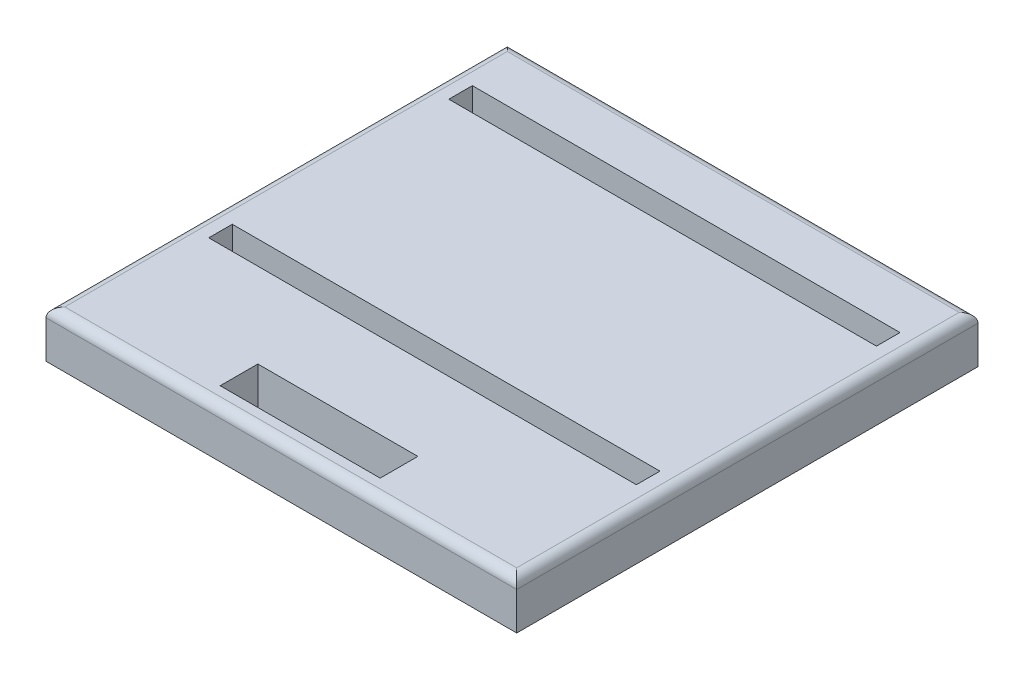
ISO-10303-21;
HEADER;
FILE_DESCRIPTION(('STEP AP214'),'2;1');
FILE_NAME('part.step','',(''),(''),'','','');
FILE_SCHEMA(('AUTOMOTIVE_DESIGN { 1 0 10303 214 1 1 1 1 }'));
ENDSEC;
DATA;
#1=APPLICATION_CONTEXT('core data for automotive mechanical design processes');
#2=APPLICATION_PROTOCOL_DEFINITION('international standard','automotive_design',2000,#1);
#3=PRODUCT_CONTEXT('',#1,'mechanical');
#4=PRODUCT('Part','Part','',(#3));
#5=PRODUCT_RELATED_PRODUCT_CATEGORY('part','',(#4));
#6=PRODUCT_DEFINITION_FORMATION('','',#4);
#7=PRODUCT_DEFINITION_CONTEXT('part definition',#1,'design');
#8=PRODUCT_DEFINITION('design','',#6,#7);
#9=PRODUCT_DEFINITION_SHAPE('','',#8);
#10=(LENGTH_UNIT() NAMED_UNIT(*) SI_UNIT(.MILLI.,.METRE.));
#11=(NAMED_UNIT(*) PLANE_ANGLE_UNIT() SI_UNIT($,.RADIAN.));
#12=(NAMED_UNIT(*) SI_UNIT($,.STERADIAN.) SOLID_ANGLE_UNIT());
#13=UNCERTAINTY_MEASURE_WITH_UNIT(LENGTH_MEASURE(1.E-05),#10,'distance_accuracy_value','');
#14=(GEOMETRIC_REPRESENTATION_CONTEXT(3) GLOBAL_UNCERTAINTY_ASSIGNED_CONTEXT((#13)) GLOBAL_UNIT_ASSIGNED_CONTEXT((#10,
#11,#12)) REPRESENTATION_CONTEXT('',''));
#15=CARTESIAN_POINT('',(0.,0.,0.));
#16=DIRECTION('',(0.,0.,1.));
#17=DIRECTION('',(1.,0.,0.));
#18=AXIS2_PLACEMENT_3D('',#15,#16,#17);
#19=CARTESIAN_POINT('',(-63.5,12.7,-81.28));
#20=DIRECTION('',(0.,0.,1.));
#21=DIRECTION('',(1.,0.,0.));
#22=AXIS2_PLACEMENT_3D('',#19,#20,#21);
#23=PLANE('',#22);
#24=DIRECTION('',(0.,-1.,0.));
#25=VECTOR('',#24,1.);
#26=CARTESIAN_POINT('',(-63.5,12.7,-81.28));
#27=LINE('',#26,#25);
#28=CARTESIAN_POINT('',(-63.5,10.16,-81.28));
#29=VERTEX_POINT('',#28);
#30=CARTESIAN_POINT('',(-63.5,0.,-81.28));
#31=VERTEX_POINT('',#30);
#32=EDGE_CURVE('E329',#29,#31,#27,.T.);
#33=ORIENTED_EDGE('',*,*,#32,.F.);
#34=DIRECTION('',(-1.,0.,0.));
#35=VECTOR('',#34,1.);
#36=CARTESIAN_POINT('',(-63.5,10.16,-81.28));
#37=LINE('',#36,#35);
#38=CARTESIAN_POINT('',(63.5,10.16,-81.28));
#39=VERTEX_POINT('',#38);
#40=EDGE_CURVE('E11',#29,#39,#37,.F.);
#41=ORIENTED_EDGE('',*,*,#40,.T.);
#42=DIRECTION('',(0.,-1.,0.));
#43=VECTOR('',#42,1.);
#44=CARTESIAN_POINT('',(63.5,12.7,-81.28));
#45=LINE('',#44,#43);
#46=CARTESIAN_POINT('',(63.5,0.,-81.28));
#47=VERTEX_POINT('',#46);
#48=EDGE_CURVE('E320',#39,#47,#45,.T.);
#49=ORIENTED_EDGE('',*,*,#48,.T.);
#50=DIRECTION('',(-1.,0.,0.));
#51=VECTOR('',#50,1.);
#52=CARTESIAN_POINT('',(-63.5,0.,-81.28));
#53=LINE('',#52,#51);
#54=EDGE_CURVE('E304',#47,#31,#53,.T.);
#55=ORIENTED_EDGE('',*,*,#54,.T.);
#56=EDGE_LOOP('',(#33,#41,#49,#55));
#57=FACE_BOUND('',#56,.T.);
#58=ADVANCED_FACE('F39',(#57),#23,.F.);
#59=CARTESIAN_POINT('',(-63.5,12.7,-81.28));
#60=DIRECTION('',(1.,0.,0.));
#61=DIRECTION('',(0.,0.,-1.));
#62=AXIS2_PLACEMENT_3D('',#59,#60,#61);
#63=PLANE('',#62);
#64=DIRECTION('',(0.,-1.,0.));
#65=VECTOR('',#64,1.);
#66=CARTESIAN_POINT('',(-63.5,12.7,43.18));
#67=LINE('',#66,#65);
#68=CARTESIAN_POINT('',(-63.5,10.16,43.18));
#69=VERTEX_POINT('',#68);
#70=CARTESIAN_POINT('',(-63.5,0.,43.18));
#71=VERTEX_POINT('',#70);
#72=EDGE_CURVE('E326',#69,#71,#67,.T.);
#73=ORIENTED_EDGE('',*,*,#72,.F.);
#74=DIRECTION('',(0.,0.,1.));
#75=VECTOR('',#74,1.);
#76=CARTESIAN_POINT('',(-63.5,10.16,-81.28));
#77=LINE('',#76,#75);
#78=EDGE_CURVE('E349',#69,#29,#77,.F.);
#79=ORIENTED_EDGE('',*,*,#78,.T.);
#80=ORIENTED_EDGE('',*,*,#32,.T.);
#81=DIRECTION('',(0.,0.,1.));
#82=VECTOR('',#81,1.);
#83=CARTESIAN_POINT('',(-63.5,0.,-81.28));
#84=LINE('',#83,#82);
#85=EDGE_CURVE('E308',#31,#71,#84,.T.);
#86=ORIENTED_EDGE('',*,*,#85,.T.);
#87=EDGE_LOOP('',(#73,#79,#80,#86));
#88=FACE_BOUND('',#87,.T.);
#89=ADVANCED_FACE('F379',(#88),#63,.F.);
#90=CARTESIAN_POINT('',(-63.5,12.7,43.18));
#91=DIRECTION('',(0.,0.,-1.));
#92=DIRECTION('',(-1.,0.,0.));
#93=AXIS2_PLACEMENT_3D('',#90,#91,#92);
#94=PLANE('',#93);
#95=DIRECTION('',(0.,-1.,0.));
#96=VECTOR('',#95,1.);
#97=CARTESIAN_POINT('',(63.5,12.7,43.18));
#98=LINE('',#97,#96);
#99=CARTESIAN_POINT('',(63.5,10.16,43.18));
#100=VERTEX_POINT('',#99);
#101=CARTESIAN_POINT('',(63.5,0.,43.18));
#102=VERTEX_POINT('',#101);
#103=EDGE_CURVE('E323',#100,#102,#98,.T.);
#104=ORIENTED_EDGE('',*,*,#103,.F.);
#105=DIRECTION('',(1.,0.,0.));
#106=VECTOR('',#105,1.);
#107=CARTESIAN_POINT('',(-63.5,10.16,43.18));
#108=LINE('',#107,#106);
#109=EDGE_CURVE('E49',#100,#69,#108,.F.);
#110=ORIENTED_EDGE('',*,*,#109,.T.);
#111=ORIENTED_EDGE('',*,*,#72,.T.);
#112=DIRECTION('',(1.,0.,0.));
#113=VECTOR('',#112,1.);
#114=CARTESIAN_POINT('',(-63.5,0.,43.18));
#115=LINE('',#114,#113);
#116=EDGE_CURVE('E312',#71,#102,#115,.T.);
#117=ORIENTED_EDGE('',*,*,#116,.T.);
#118=EDGE_LOOP('',(#104,#110,#111,#117));
#119=FACE_BOUND('',#118,.T.);
#120=ADVANCED_FACE('F389',(#119),#94,.F.);
#121=CARTESIAN_POINT('',(63.5,12.7,-81.28));
#122=DIRECTION('',(-1.,0.,0.));
#123=DIRECTION('',(0.,0.,1.));
#124=AXIS2_PLACEMENT_3D('',#121,#122,#123);
#125=PLANE('',#124);
#126=ORIENTED_EDGE('',*,*,#48,.F.);
#127=DIRECTION('',(0.,0.,-1.));
#128=VECTOR('',#127,1.);
#129=CARTESIAN_POINT('',(63.5,10.16,-81.28));
#130=LINE('',#129,#128);
#131=EDGE_CURVE('E345',#39,#100,#130,.F.);
#132=ORIENTED_EDGE('',*,*,#131,.T.);
#133=ORIENTED_EDGE('',*,*,#103,.T.);
#134=DIRECTION('',(0.,0.,-1.));
#135=VECTOR('',#134,1.);
#136=CARTESIAN_POINT('',(63.5,0.,-81.28));
#137=LINE('',#136,#135);
#138=EDGE_CURVE('E316',#102,#47,#137,.T.);
#139=ORIENTED_EDGE('',*,*,#138,.T.);
#140=EDGE_LOOP('',(#126,#132,#133,#139));
#141=FACE_BOUND('',#140,.T.);
#142=ADVANCED_FACE('F391',(#141),#125,.F.);
#143=CARTESIAN_POINT('',(0.,12.7,0.));
#144=DIRECTION('',(0.,-1.,0.));
#145=DIRECTION('',(0.,0.,-1.));
#146=AXIS2_PLACEMENT_3D('',#143,#144,#145);
#147=PLANE('',#146);
#148=DIRECTION('',(0.,0.,-1.));
#149=VECTOR('',#148,1.);
#150=CARTESIAN_POINT('',(57.6927726,12.7,-59.69));
#151=LINE('',#150,#149);
#152=CARTESIAN_POINT('',(57.6927726,12.7,-59.69));
#153=VERTEX_POINT('',#152);
#154=CARTESIAN_POINT('',(57.6927726,12.7,-66.04));
#155=VERTEX_POINT('',#154);
#156=EDGE_CURVE('E203',#153,#155,#151,.T.);
#157=ORIENTED_EDGE('',*,*,#156,.F.);
#158=DIRECTION('',(1.,0.,0.));
#159=VECTOR('',#158,1.);
#160=CARTESIAN_POINT('',(57.6927726,12.7,-59.69));
#161=LINE('',#160,#159);
#162=CARTESIAN_POINT('',(-57.69277768,12.7,-59.69));
#163=VERTEX_POINT('',#162);
#164=EDGE_CURVE('E57',#163,#153,#161,.T.);
#165=ORIENTED_EDGE('',*,*,#164,.F.);
#166=DIRECTION('',(0.,0.,1.));
#167=VECTOR('',#166,1.);
#168=CARTESIAN_POINT('',(-57.69277768,12.7,-59.69));
#169=LINE('',#168,#167);
#170=CARTESIAN_POINT('',(-57.69277768,12.7,-66.0399999999999));
#171=VERTEX_POINT('',#170);
#172=EDGE_CURVE('E190',#171,#163,#169,.T.);
#173=ORIENTED_EDGE('',*,*,#172,.F.);
#174=DIRECTION('',(-1.,0.,0.));
#175=VECTOR('',#174,1.);
#176=CARTESIAN_POINT('',(57.6927726,12.7,-66.04));
#177=LINE('',#176,#175);
#178=EDGE_CURVE('E194',#155,#171,#177,.T.);
#179=ORIENTED_EDGE('',*,*,#178,.F.);
#180=EDGE_LOOP('',(#157,#165,#173,#179));
#181=FACE_BOUND('',#180,.T.);
#182=DIRECTION('',(0.,0.,-1.));
#183=VECTOR('',#182,1.);
#184=CARTESIAN_POINT('',(21.59,12.7,27.94));
#185=LINE('',#184,#183);
#186=CARTESIAN_POINT('',(21.59,12.7,38.1));
#187=VERTEX_POINT('',#186);
#188=CARTESIAN_POINT('',(21.59,12.7,27.94));
#189=VERTEX_POINT('',#188);
#190=EDGE_CURVE('E239',#187,#189,#185,.T.);
#191=ORIENTED_EDGE('',*,*,#190,.F.);
#192=DIRECTION('',(1.,0.,0.));
#193=VECTOR('',#192,1.);
#194=CARTESIAN_POINT('',(21.59,12.7,38.1));
#195=LINE('',#194,#193);
#196=CARTESIAN_POINT('',(-21.59,12.7,38.1));
#197=VERTEX_POINT('',#196);
#198=EDGE_CURVE('E65',#197,#187,#195,.T.);
#199=ORIENTED_EDGE('',*,*,#198,.F.);
#200=DIRECTION('',(0.,0.,1.));
#201=VECTOR('',#200,1.);
#202=CARTESIAN_POINT('',(-21.59,12.7,38.1));
#203=LINE('',#202,#201);
#204=CARTESIAN_POINT('',(-21.59,12.7,27.94));
#205=VERTEX_POINT('',#204);
#206=EDGE_CURVE('E224',#205,#197,#203,.T.);
#207=ORIENTED_EDGE('',*,*,#206,.F.);
#208=DIRECTION('',(-1.,0.,0.));
#209=VECTOR('',#208,1.);
#210=CARTESIAN_POINT('',(-21.59,12.7,27.94));
#211=LINE('',#210,#209);
#212=EDGE_CURVE('E244',#189,#205,#211,.T.);
#213=ORIENTED_EDGE('',*,*,#212,.F.);
#214=EDGE_LOOP('',(#191,#199,#207,#213));
#215=FACE_BOUND('',#214,.T.);
#216=DIRECTION('',(0.,0.,1.));
#217=VECTOR('',#216,1.);
#218=CARTESIAN_POINT('',(-57.69277768,12.7,-1.26999999999999));
#219=LINE('',#218,#217);
#220=CARTESIAN_POINT('',(-57.69277768,12.7,-1.26999999999999));
#221=VERTEX_POINT('',#220);
#222=CARTESIAN_POINT('',(-57.69277768,12.7,5.08000000000002));
#223=VERTEX_POINT('',#222);
#224=EDGE_CURVE('E282',#221,#223,#219,.T.);
#225=ORIENTED_EDGE('',*,*,#224,.F.);
#226=DIRECTION('',(-1.,0.,0.));
#227=VECTOR('',#226,1.);
#228=CARTESIAN_POINT('',(57.6927726,12.7,-1.27));
#229=LINE('',#228,#227);
#230=CARTESIAN_POINT('',(57.6927726,12.7,-1.27));
#231=VERTEX_POINT('',#230);
#232=EDGE_CURVE('E279',#231,#221,#229,.T.);
#233=ORIENTED_EDGE('',*,*,#232,.F.);
#234=DIRECTION('',(0.,0.,-1.));
#235=VECTOR('',#234,1.);
#236=CARTESIAN_POINT('',(57.6927726,12.7,-1.27));
#237=LINE('',#236,#235);
#238=CARTESIAN_POINT('',(57.6927726,12.7,5.08));
#239=VERTEX_POINT('',#238);
#240=EDGE_CURVE('E266',#239,#231,#237,.T.);
#241=ORIENTED_EDGE('',*,*,#240,.F.);
#242=DIRECTION('',(1.,0.,0.));
#243=VECTOR('',#242,1.);
#244=CARTESIAN_POINT('',(57.6927726,12.7,5.08));
#245=LINE('',#244,#243);
#246=EDGE_CURVE('E286',#223,#239,#245,.T.);
#247=ORIENTED_EDGE('',*,*,#246,.F.);
#248=EDGE_LOOP('',(#225,#233,#241,#247));
#249=FACE_BOUND('',#248,.T.);
#250=DIRECTION('',(0.,0.,1.));
#251=VECTOR('',#250,1.);
#252=CARTESIAN_POINT('',(-60.96,12.7,0.));
#253=LINE('',#252,#251);
#254=CARTESIAN_POINT('',(-60.96,12.7,-78.74));
#255=VERTEX_POINT('',#254);
#256=CARTESIAN_POINT('',(-60.96,12.7,40.64));
#257=VERTEX_POINT('',#256);
#258=EDGE_CURVE('E335',#255,#257,#253,.T.);
#259=ORIENTED_EDGE('',*,*,#258,.T.);
#260=DIRECTION('',(1.,0.,0.));
#261=VECTOR('',#260,1.);
#262=CARTESIAN_POINT('',(0.,12.7,40.64));
#263=LINE('',#262,#261);
#264=CARTESIAN_POINT('',(60.96,12.7,40.64));
#265=VERTEX_POINT('',#264);
#266=EDGE_CURVE('E342',#257,#265,#263,.T.);
#267=ORIENTED_EDGE('',*,*,#266,.T.);
#268=DIRECTION('',(0.,0.,-1.));
#269=VECTOR('',#268,1.);
#270=CARTESIAN_POINT('',(60.96,12.7,0.));
#271=LINE('',#270,#269);
#272=CARTESIAN_POINT('',(60.96,12.7,-78.74));
#273=VERTEX_POINT('',#272);
#274=EDGE_CURVE('E338',#265,#273,#271,.T.);
#275=ORIENTED_EDGE('',*,*,#274,.T.);
#276=DIRECTION('',(-1.,0.,0.));
#277=VECTOR('',#276,1.);
#278=CARTESIAN_POINT('',(0.,12.7,-78.74));
#279=LINE('',#278,#277);
#280=EDGE_CURVE('E332',#273,#255,#279,.T.);
#281=ORIENTED_EDGE('',*,*,#280,.T.);
#282=EDGE_LOOP('',(#259,#267,#275,#281));
#283=FACE_BOUND('',#282,.T.);
#284=ADVANCED_FACE('F399',(#181,#215,#249,#283),#147,.F.);
#285=CARTESIAN_POINT('',(0.,0.,0.));
#286=DIRECTION('',(0.,-1.,0.));
#287=DIRECTION('',(0.,0.,-1.));
#288=AXIS2_PLACEMENT_3D('',#285,#286,#287);
#289=PLANE('',#288);
#290=DIRECTION('',(1.,0.,0.));
#291=VECTOR('',#290,1.);
#292=CARTESIAN_POINT('',(57.6927726,0.,-59.69));
#293=LINE('',#292,#291);
#294=CARTESIAN_POINT('',(-57.69277768,0.,-59.69));
#295=VERTEX_POINT('',#294);
#296=CARTESIAN_POINT('',(57.6927726,0.,-59.69));
#297=VERTEX_POINT('',#296);
#298=EDGE_CURVE('E168',#295,#297,#293,.T.);
#299=ORIENTED_EDGE('',*,*,#298,.T.);
#300=DIRECTION('',(0.,0.,-1.));
#301=VECTOR('',#300,1.);
#302=CARTESIAN_POINT('',(57.6927726,0.,-59.69));
#303=LINE('',#302,#301);
#304=CARTESIAN_POINT('',(57.6927726,0.,-66.04));
#305=VERTEX_POINT('',#304);
#306=EDGE_CURVE('E179',#297,#305,#303,.T.);
#307=ORIENTED_EDGE('',*,*,#306,.T.);
#308=DIRECTION('',(-1.,0.,0.));
#309=VECTOR('',#308,1.);
#310=CARTESIAN_POINT('',(57.6927726,0.,-66.04));
#311=LINE('',#310,#309);
#312=CARTESIAN_POINT('',(-57.69277768,0.,-66.0399999999999));
#313=VERTEX_POINT('',#312);
#314=EDGE_CURVE('E184',#305,#313,#311,.T.);
#315=ORIENTED_EDGE('',*,*,#314,.T.);
#316=DIRECTION('',(0.,0.,1.));
#317=VECTOR('',#316,1.);
#318=CARTESIAN_POINT('',(-57.69277768,0.,-59.69));
#319=LINE('',#318,#317);
#320=EDGE_CURVE('E175',#313,#295,#319,.T.);
#321=ORIENTED_EDGE('',*,*,#320,.T.);
#322=EDGE_LOOP('',(#299,#307,#315,#321));
#323=FACE_BOUND('',#322,.T.);
#324=DIRECTION('',(1.,0.,0.));
#325=VECTOR('',#324,1.);
#326=CARTESIAN_POINT('',(21.59,0.,38.1));
#327=LINE('',#326,#325);
#328=CARTESIAN_POINT('',(-21.59,0.,38.1));
#329=VERTEX_POINT('',#328);
#330=CARTESIAN_POINT('',(21.59,0.,38.1));
#331=VERTEX_POINT('',#330);
#332=EDGE_CURVE('E219',#329,#331,#327,.T.);
#333=ORIENTED_EDGE('',*,*,#332,.T.);
#334=DIRECTION('',(0.,0.,-1.));
#335=VECTOR('',#334,1.);
#336=CARTESIAN_POINT('',(21.59,0.,27.94));
#337=LINE('',#336,#335);
#338=CARTESIAN_POINT('',(21.59,0.,27.94));
#339=VERTEX_POINT('',#338);
#340=EDGE_CURVE('E223',#331,#339,#337,.T.);
#341=ORIENTED_EDGE('',*,*,#340,.T.);
#342=DIRECTION('',(-1.,0.,0.));
#343=VECTOR('',#342,1.);
#344=CARTESIAN_POINT('',(-21.59,0.,27.94));
#345=LINE('',#344,#343);
#346=CARTESIAN_POINT('',(-21.59,0.,27.94));
#347=VERTEX_POINT('',#346);
#348=EDGE_CURVE('E228',#339,#347,#345,.T.);
#349=ORIENTED_EDGE('',*,*,#348,.T.);
#350=DIRECTION('',(0.,0.,1.));
#351=VECTOR('',#350,1.);
#352=CARTESIAN_POINT('',(-21.59,0.,38.1));
#353=LINE('',#352,#351);
#354=EDGE_CURVE('E232',#347,#329,#353,.T.);
#355=ORIENTED_EDGE('',*,*,#354,.T.);
#356=EDGE_LOOP('',(#333,#341,#349,#355));
#357=FACE_BOUND('',#356,.T.);
#358=DIRECTION('',(-1.,0.,0.));
#359=VECTOR('',#358,1.);
#360=CARTESIAN_POINT('',(57.6927726,0.,-1.27));
#361=LINE('',#360,#359);
#362=CARTESIAN_POINT('',(57.6927726,0.,-1.27));
#363=VERTEX_POINT('',#362);
#364=CARTESIAN_POINT('',(-57.69277768,0.,-1.26999999999999));
#365=VERTEX_POINT('',#364);
#366=EDGE_CURVE('E261',#363,#365,#361,.T.);
#367=ORIENTED_EDGE('',*,*,#366,.T.);
#368=DIRECTION('',(0.,0.,1.));
#369=VECTOR('',#368,1.);
#370=CARTESIAN_POINT('',(-57.69277768,0.,-1.26999999999999));
#371=LINE('',#370,#369);
#372=CARTESIAN_POINT('',(-57.69277768,0.,5.08000000000002));
#373=VERTEX_POINT('',#372);
#374=EDGE_CURVE('E265',#365,#373,#371,.T.);
#375=ORIENTED_EDGE('',*,*,#374,.T.);
#376=DIRECTION('',(1.,0.,0.));
#377=VECTOR('',#376,1.);
#378=CARTESIAN_POINT('',(57.6927726,0.,5.08));
#379=LINE('',#378,#377);
#380=CARTESIAN_POINT('',(57.6927726,0.,5.08));
#381=VERTEX_POINT('',#380);
#382=EDGE_CURVE('E270',#373,#381,#379,.T.);
#383=ORIENTED_EDGE('',*,*,#382,.T.);
#384=DIRECTION('',(0.,0.,-1.));
#385=VECTOR('',#384,1.);
#386=CARTESIAN_POINT('',(57.6927726,0.,-1.27));
#387=LINE('',#386,#385);
#388=EDGE_CURVE('E274',#381,#363,#387,.T.);
#389=ORIENTED_EDGE('',*,*,#388,.T.);
#390=EDGE_LOOP('',(#367,#375,#383,#389));
#391=FACE_BOUND('',#390,.T.);
#392=ORIENTED_EDGE('',*,*,#54,.F.);
#393=ORIENTED_EDGE('',*,*,#138,.F.);
#394=ORIENTED_EDGE('',*,*,#116,.F.);
#395=ORIENTED_EDGE('',*,*,#85,.F.);
#396=EDGE_LOOP('',(#392,#393,#394,#395));
#397=FACE_BOUND('',#396,.T.);
#398=ADVANCED_FACE('F186',(#323,#357,#391,#397),#289,.T.);
#399=CARTESIAN_POINT('',(-60.96,10.16,0.));
#400=DIRECTION('',(0.,0.,1.));
#401=DIRECTION('',(1.,0.,0.));
#402=AXIS2_PLACEMENT_3D('',#399,#400,#401);
#403=CYLINDRICAL_SURFACE('',#402,2.54);
#404=CARTESIAN_POINT('',(-60.96,10.16,-78.74));
#405=DIRECTION('',(-0.707106781186547,0.,0.707106781186548));
#406=DIRECTION('',(-0.707106781186548,0.,-0.707106781186547));
#407=AXIS2_PLACEMENT_3D('',#404,#405,#406);
#408=ELLIPSE('',#407,3.59210244842766,2.54);
#409=EDGE_CURVE('E358',#29,#255,#408,.F.);
#410=ORIENTED_EDGE('',*,*,#409,.F.);
#411=ORIENTED_EDGE('',*,*,#78,.F.);
#412=CARTESIAN_POINT('',(-60.96,10.16,40.64));
#413=DIRECTION('',(0.707106781186548,0.,0.707106781186547));
#414=DIRECTION('',(0.707106781186547,0.,-0.707106781186548));
#415=AXIS2_PLACEMENT_3D('',#412,#413,#414);
#416=ELLIPSE('',#415,3.59210244842766,2.54);
#417=EDGE_CURVE('E43',#257,#69,#416,.T.);
#418=ORIENTED_EDGE('',*,*,#417,.F.);
#419=ORIENTED_EDGE('',*,*,#258,.F.);
#420=EDGE_LOOP('',(#410,#411,#418,#419));
#421=FACE_BOUND('',#420,.T.);
#422=ADVANCED_FACE('F41',(#421),#403,.T.);
#423=CARTESIAN_POINT('',(0.,10.16,40.64));
#424=DIRECTION('',(1.,0.,0.));
#425=DIRECTION('',(0.,0.,-1.));
#426=AXIS2_PLACEMENT_3D('',#423,#424,#425);
#427=CYLINDRICAL_SURFACE('',#426,2.54);
#428=ORIENTED_EDGE('',*,*,#417,.T.);
#429=ORIENTED_EDGE('',*,*,#109,.F.);
#430=CARTESIAN_POINT('',(60.96,10.16,40.64));
#431=DIRECTION('',(0.707106781186547,0.,-0.707106781186548));
#432=DIRECTION('',(0.707106781186548,0.,0.707106781186547));
#433=AXIS2_PLACEMENT_3D('',#430,#431,#432);
#434=ELLIPSE('',#433,3.59210244842766,2.54);
#435=EDGE_CURVE('E356',#265,#100,#434,.T.);
#436=ORIENTED_EDGE('',*,*,#435,.F.);
#437=ORIENTED_EDGE('',*,*,#266,.F.);
#438=EDGE_LOOP('',(#428,#429,#436,#437));
#439=FACE_BOUND('',#438,.T.);
#440=ADVANCED_FACE('F371',(#439),#427,.T.);
#441=CARTESIAN_POINT('',(0.,10.16,-78.74));
#442=DIRECTION('',(-1.,0.,0.));
#443=DIRECTION('',(0.,0.,1.));
#444=AXIS2_PLACEMENT_3D('',#441,#442,#443);
#445=CYLINDRICAL_SURFACE('',#444,2.54);
#446=ORIENTED_EDGE('',*,*,#409,.T.);
#447=ORIENTED_EDGE('',*,*,#280,.F.);
#448=CARTESIAN_POINT('',(60.96,10.16,-78.74));
#449=DIRECTION('',(-0.707106781186548,0.,-0.707106781186547));
#450=DIRECTION('',(-0.707106781186547,0.,0.707106781186548));
#451=AXIS2_PLACEMENT_3D('',#448,#449,#450);
#452=ELLIPSE('',#451,3.59210244842766,2.54);
#453=EDGE_CURVE('E213',#39,#273,#452,.F.);
#454=ORIENTED_EDGE('',*,*,#453,.F.);
#455=ORIENTED_EDGE('',*,*,#40,.F.);
#456=EDGE_LOOP('',(#446,#447,#454,#455));
#457=FACE_BOUND('',#456,.T.);
#458=ADVANCED_FACE('F397',(#457),#445,.T.);
#459=CARTESIAN_POINT('',(60.96,10.16,0.));
#460=DIRECTION('',(0.,0.,-1.));
#461=DIRECTION('',(-1.,0.,0.));
#462=AXIS2_PLACEMENT_3D('',#459,#460,#461);
#463=CYLINDRICAL_SURFACE('',#462,2.54);
#464=ORIENTED_EDGE('',*,*,#435,.T.);
#465=ORIENTED_EDGE('',*,*,#131,.F.);
#466=ORIENTED_EDGE('',*,*,#453,.T.);
#467=ORIENTED_EDGE('',*,*,#274,.F.);
#468=EDGE_LOOP('',(#464,#465,#466,#467));
#469=FACE_BOUND('',#468,.T.);
#470=ADVANCED_FACE('F395',(#469),#463,.T.);
#471=CARTESIAN_POINT('',(57.6927726,0.,-1.27));
#472=DIRECTION('',(0.,0.,-1.));
#473=DIRECTION('',(-1.,0.,0.));
#474=AXIS2_PLACEMENT_3D('',#471,#472,#473);
#475=PLANE('',#474);
#476=ORIENTED_EDGE('',*,*,#232,.T.);
#477=DIRECTION('',(0.,1.,0.));
#478=VECTOR('',#477,1.);
#479=CARTESIAN_POINT('',(-57.69277768,0.,-1.26999999999999));
#480=LINE('',#479,#478);
#481=EDGE_CURVE('E278',#365,#221,#480,.T.);
#482=ORIENTED_EDGE('',*,*,#481,.F.);
#483=ORIENTED_EDGE('',*,*,#366,.F.);
#484=DIRECTION('',(0.,1.,0.));
#485=VECTOR('',#484,1.);
#486=CARTESIAN_POINT('',(57.6927726,0.,-1.27));
#487=LINE('',#486,#485);
#488=EDGE_CURVE('E240',#363,#231,#487,.T.);
#489=ORIENTED_EDGE('',*,*,#488,.T.);
#490=EDGE_LOOP('',(#476,#482,#483,#489));
#491=FACE_BOUND('',#490,.T.);
#492=ADVANCED_FACE('F421',(#491),#475,.F.);
#493=CARTESIAN_POINT('',(57.6927726,0.,-1.27));
#494=DIRECTION('',(1.,0.,0.));
#495=DIRECTION('',(0.,0.,-1.));
#496=AXIS2_PLACEMENT_3D('',#493,#494,#495);
#497=PLANE('',#496);
#498=ORIENTED_EDGE('',*,*,#240,.T.);
#499=ORIENTED_EDGE('',*,*,#488,.F.);
#500=ORIENTED_EDGE('',*,*,#388,.F.);
#501=DIRECTION('',(0.,1.,0.));
#502=VECTOR('',#501,1.);
#503=CARTESIAN_POINT('',(57.6927726,0.,5.08));
#504=LINE('',#503,#502);
#505=EDGE_CURVE('E295',#381,#239,#504,.T.);
#506=ORIENTED_EDGE('',*,*,#505,.T.);
#507=EDGE_LOOP('',(#498,#499,#500,#506));
#508=FACE_BOUND('',#507,.T.);
#509=ADVANCED_FACE('F446',(#508),#497,.F.);
#510=CARTESIAN_POINT('',(57.6927726,0.,5.08));
#511=DIRECTION('',(0.,0.,1.));
#512=DIRECTION('',(1.,0.,0.));
#513=AXIS2_PLACEMENT_3D('',#510,#511,#512);
#514=PLANE('',#513);
#515=ORIENTED_EDGE('',*,*,#246,.T.);
#516=ORIENTED_EDGE('',*,*,#505,.F.);
#517=ORIENTED_EDGE('',*,*,#382,.F.);
#518=DIRECTION('',(0.,1.,0.));
#519=VECTOR('',#518,1.);
#520=CARTESIAN_POINT('',(-57.69277768,0.,5.08000000000002));
#521=LINE('',#520,#519);
#522=EDGE_CURVE('E298',#373,#223,#521,.T.);
#523=ORIENTED_EDGE('',*,*,#522,.T.);
#524=EDGE_LOOP('',(#515,#516,#517,#523));
#525=FACE_BOUND('',#524,.T.);
#526=ADVANCED_FACE('F456',(#525),#514,.F.);
#527=CARTESIAN_POINT('',(-57.69277768,0.,-1.26999999999999));
#528=DIRECTION('',(-1.,0.,0.));
#529=DIRECTION('',(0.,0.,1.));
#530=AXIS2_PLACEMENT_3D('',#527,#528,#529);
#531=PLANE('',#530);
#532=ORIENTED_EDGE('',*,*,#224,.T.);
#533=ORIENTED_EDGE('',*,*,#522,.F.);
#534=ORIENTED_EDGE('',*,*,#374,.F.);
#535=ORIENTED_EDGE('',*,*,#481,.T.);
#536=EDGE_LOOP('',(#532,#533,#534,#535));
#537=FACE_BOUND('',#536,.T.);
#538=ADVANCED_FACE('F466',(#537),#531,.F.);
#539=CARTESIAN_POINT('',(21.59,0.,38.1));
#540=DIRECTION('',(0.,0.,1.));
#541=DIRECTION('',(1.,0.,0.));
#542=AXIS2_PLACEMENT_3D('',#539,#540,#541);
#543=PLANE('',#542);
#544=ORIENTED_EDGE('',*,*,#198,.T.);
#545=DIRECTION('',(0.,1.,0.));
#546=VECTOR('',#545,1.);
#547=CARTESIAN_POINT('',(21.59,0.,38.1));
#548=LINE('',#547,#546);
#549=EDGE_CURVE('E236',#331,#187,#548,.T.);
#550=ORIENTED_EDGE('',*,*,#549,.F.);
#551=ORIENTED_EDGE('',*,*,#332,.F.);
#552=DIRECTION('',(0.,1.,0.));
#553=VECTOR('',#552,1.);
#554=CARTESIAN_POINT('',(-21.59,0.,38.1));
#555=LINE('',#554,#553);
#556=EDGE_CURVE('E204',#329,#197,#555,.T.);
#557=ORIENTED_EDGE('',*,*,#556,.T.);
#558=EDGE_LOOP('',(#544,#550,#551,#557));
#559=FACE_BOUND('',#558,.T.);
#560=ADVANCED_FACE('F476',(#559),#543,.F.);
#561=CARTESIAN_POINT('',(-21.59,0.,38.1));
#562=DIRECTION('',(-1.,0.,0.));
#563=DIRECTION('',(0.,0.,1.));
#564=AXIS2_PLACEMENT_3D('',#561,#562,#563);
#565=PLANE('',#564);
#566=ORIENTED_EDGE('',*,*,#206,.T.);
#567=ORIENTED_EDGE('',*,*,#556,.F.);
#568=ORIENTED_EDGE('',*,*,#354,.F.);
#569=DIRECTION('',(0.,1.,0.));
#570=VECTOR('',#569,1.);
#571=CARTESIAN_POINT('',(-21.59,0.,27.94));
#572=LINE('',#571,#570);
#573=EDGE_CURVE('E253',#347,#205,#572,.T.);
#574=ORIENTED_EDGE('',*,*,#573,.T.);
#575=EDGE_LOOP('',(#566,#567,#568,#574));
#576=FACE_BOUND('',#575,.T.);
#577=ADVANCED_FACE('F486',(#576),#565,.F.);
#578=CARTESIAN_POINT('',(-21.59,0.,27.94));
#579=DIRECTION('',(0.,0.,-1.));
#580=DIRECTION('',(-1.,0.,0.));
#581=AXIS2_PLACEMENT_3D('',#578,#579,#580);
#582=PLANE('',#581);
#583=ORIENTED_EDGE('',*,*,#212,.T.);
#584=ORIENTED_EDGE('',*,*,#573,.F.);
#585=ORIENTED_EDGE('',*,*,#348,.F.);
#586=DIRECTION('',(0.,1.,0.));
#587=VECTOR('',#586,1.);
#588=CARTESIAN_POINT('',(21.59,0.,27.94));
#589=LINE('',#588,#587);
#590=EDGE_CURVE('E256',#339,#189,#589,.T.);
#591=ORIENTED_EDGE('',*,*,#590,.T.);
#592=EDGE_LOOP('',(#583,#584,#585,#591));
#593=FACE_BOUND('',#592,.T.);
#594=ADVANCED_FACE('F495',(#593),#582,.F.);
#595=CARTESIAN_POINT('',(21.59,0.,27.94));
#596=DIRECTION('',(1.,0.,0.));
#597=DIRECTION('',(0.,0.,-1.));
#598=AXIS2_PLACEMENT_3D('',#595,#596,#597);
#599=PLANE('',#598);
#600=ORIENTED_EDGE('',*,*,#190,.T.);
#601=ORIENTED_EDGE('',*,*,#590,.F.);
#602=ORIENTED_EDGE('',*,*,#340,.F.);
#603=ORIENTED_EDGE('',*,*,#549,.T.);
#604=EDGE_LOOP('',(#600,#601,#602,#603));
#605=FACE_BOUND('',#604,.T.);
#606=ADVANCED_FACE('F505',(#605),#599,.F.);
#607=CARTESIAN_POINT('',(57.6927726,0.,-59.69));
#608=DIRECTION('',(0.,0.,1.));
#609=DIRECTION('',(1.,0.,0.));
#610=AXIS2_PLACEMENT_3D('',#607,#608,#609);
#611=PLANE('',#610);
#612=ORIENTED_EDGE('',*,*,#164,.T.);
#613=DIRECTION('',(0.,1.,0.));
#614=VECTOR('',#613,1.);
#615=CARTESIAN_POINT('',(57.6927726,0.,-59.69));
#616=LINE('',#615,#614);
#617=EDGE_CURVE('E164',#297,#153,#616,.T.);
#618=ORIENTED_EDGE('',*,*,#617,.F.);
#619=ORIENTED_EDGE('',*,*,#298,.F.);
#620=DIRECTION('',(0.,1.,0.));
#621=VECTOR('',#620,1.);
#622=CARTESIAN_POINT('',(-57.69277768,0.,-59.69));
#623=LINE('',#622,#621);
#624=EDGE_CURVE('E210',#295,#163,#623,.T.);
#625=ORIENTED_EDGE('',*,*,#624,.T.);
#626=EDGE_LOOP('',(#612,#618,#619,#625));
#627=FACE_BOUND('',#626,.T.);
#628=ADVANCED_FACE('F166',(#627),#611,.F.);
#629=CARTESIAN_POINT('',(-57.69277768,0.,-59.69));
#630=DIRECTION('',(-1.,0.,0.));
#631=DIRECTION('',(0.,0.,1.));
#632=AXIS2_PLACEMENT_3D('',#629,#630,#631);
#633=PLANE('',#632);
#634=ORIENTED_EDGE('',*,*,#172,.T.);
#635=ORIENTED_EDGE('',*,*,#624,.F.);
#636=ORIENTED_EDGE('',*,*,#320,.F.);
#637=DIRECTION('',(0.,1.,0.));
#638=VECTOR('',#637,1.);
#639=CARTESIAN_POINT('',(-57.69277768,0.,-66.0399999999999));
#640=LINE('',#639,#638);
#641=EDGE_CURVE('E214',#313,#171,#640,.T.);
#642=ORIENTED_EDGE('',*,*,#641,.T.);
#643=EDGE_LOOP('',(#634,#635,#636,#642));
#644=FACE_BOUND('',#643,.T.);
#645=ADVANCED_FACE('F524',(#644),#633,.F.);
#646=CARTESIAN_POINT('',(57.6927726,0.,-66.04));
#647=DIRECTION('',(0.,0.,-1.));
#648=DIRECTION('',(-1.,0.,0.));
#649=AXIS2_PLACEMENT_3D('',#646,#647,#648);
#650=PLANE('',#649);
#651=ORIENTED_EDGE('',*,*,#178,.T.);
#652=ORIENTED_EDGE('',*,*,#641,.F.);
#653=ORIENTED_EDGE('',*,*,#314,.F.);
#654=DIRECTION('',(0.,1.,0.));
#655=VECTOR('',#654,1.);
#656=CARTESIAN_POINT('',(57.6927726,0.,-66.04));
#657=LINE('',#656,#655);
#658=EDGE_CURVE('E174',#305,#155,#657,.T.);
#659=ORIENTED_EDGE('',*,*,#658,.T.);
#660=EDGE_LOOP('',(#651,#652,#653,#659));
#661=FACE_BOUND('',#660,.T.);
#662=ADVANCED_FACE('F533',(#661),#650,.F.);
#663=CARTESIAN_POINT('',(57.6927726,0.,-59.69));
#664=DIRECTION('',(1.,0.,0.));
#665=DIRECTION('',(0.,0.,-1.));
#666=AXIS2_PLACEMENT_3D('',#663,#664,#665);
#667=PLANE('',#666);
#668=ORIENTED_EDGE('',*,*,#156,.T.);
#669=ORIENTED_EDGE('',*,*,#658,.F.);
#670=ORIENTED_EDGE('',*,*,#306,.F.);
#671=ORIENTED_EDGE('',*,*,#617,.T.);
#672=EDGE_LOOP('',(#668,#669,#670,#671));
#673=FACE_BOUND('',#672,.T.);
#674=ADVANCED_FACE('F180',(#673),#667,.F.);
#675=CLOSED_SHELL('',(#58,#89,#120,#142,#284,#398,#422,#440,#458,#470,#492,#509,#526,#538,#560,
#577,#594,#606,#628,#645,#662,#674));
#676=MANIFOLD_SOLID_BREP('B2',#675);
#677=ADVANCED_BREP_SHAPE_REPRESENTATION('',(#18,#676),#14);
#678=SHAPE_DEFINITION_REPRESENTATION(#9,#677);
ENDSEC;
END-ISO-10303-21;
